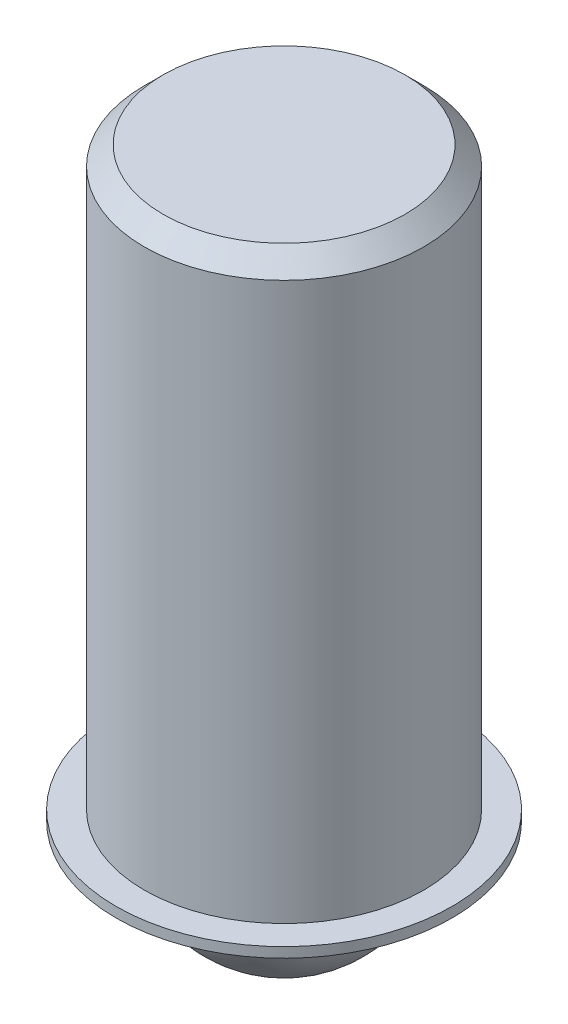
ISO-10303-21;
HEADER;
FILE_DESCRIPTION(('STEP AP214'),'2;1');
FILE_NAME('part.step','',(''),(''),'','','');
FILE_SCHEMA(('AUTOMOTIVE_DESIGN { 1 0 10303 214 1 1 1 1 }'));
ENDSEC;
DATA;
#1=APPLICATION_CONTEXT('core data for automotive mechanical design processes');
#2=APPLICATION_PROTOCOL_DEFINITION('international standard','automotive_design',2000,#1);
#3=PRODUCT_CONTEXT('',#1,'mechanical');
#4=PRODUCT('Part','Part','',(#3));
#5=PRODUCT_RELATED_PRODUCT_CATEGORY('part','',(#4));
#6=PRODUCT_DEFINITION_FORMATION('','',#4);
#7=PRODUCT_DEFINITION_CONTEXT('part definition',#1,'design');
#8=PRODUCT_DEFINITION('design','',#6,#7);
#9=PRODUCT_DEFINITION_SHAPE('','',#8);
#10=(LENGTH_UNIT() NAMED_UNIT(*) SI_UNIT(.MILLI.,.METRE.));
#11=(NAMED_UNIT(*) PLANE_ANGLE_UNIT() SI_UNIT($,.RADIAN.));
#12=(NAMED_UNIT(*) SI_UNIT($,.STERADIAN.) SOLID_ANGLE_UNIT());
#13=UNCERTAINTY_MEASURE_WITH_UNIT(LENGTH_MEASURE(1.E-05),#10,'distance_accuracy_value','');
#14=(GEOMETRIC_REPRESENTATION_CONTEXT(3) GLOBAL_UNCERTAINTY_ASSIGNED_CONTEXT((#13)) GLOBAL_UNIT_ASSIGNED_CONTEXT((#10,
#11,#12)) REPRESENTATION_CONTEXT('',''));
#15=CARTESIAN_POINT('',(0.,0.,0.));
#16=DIRECTION('',(0.,0.,1.));
#17=DIRECTION('',(1.,0.,0.));
#18=AXIS2_PLACEMENT_3D('',#15,#16,#17);
#19=CARTESIAN_POINT('',(0.,-6.7056,0.));
#20=DIRECTION('',(0.,0.,1.));
#21=DIRECTION('',(0.,1.,0.));
#22=AXIS2_PLACEMENT_3D('',#19,#20,#21);
#23=SPHERICAL_SURFACE('',#22,3.175);
#24=CARTESIAN_POINT('',(0.,-6.7056,-3.175));
#25=VERTEX_POINT('',#24);
#26=VERTEX_LOOP('',#25);
#27=FACE_BOUND('',#26,.T.);
#28=CARTESIAN_POINT('',(0.,-6.7056,3.175));
#29=VERTEX_POINT('',#28);
#30=VERTEX_LOOP('',#29);
#31=FACE_BOUND('',#30,.T.);
#32=ADVANCED_FACE('P0_F15',(#27,#31),#23,.T.);
#33=CLOSED_SHELL('',(#32));
#34=MANIFOLD_SOLID_BREP('P0_B1',#33);
#35=CARTESIAN_POINT('',(0.,-6.4516,3.175));
#36=DIRECTION('',(0.,-1.,0.));
#37=DIRECTION('',(0.,0.,-1.));
#38=AXIS2_PLACEMENT_3D('',#35,#36,#37);
#39=PLANE('',#38);
#40=CARTESIAN_POINT('',(0.,-6.4516,0.));
#41=DIRECTION('',(0.,1.,0.));
#42=DIRECTION('',(0.,0.,1.));
#43=AXIS2_PLACEMENT_3D('',#40,#41,#42);
#44=CIRCLE('',#43,3.175);
#45=CARTESIAN_POINT('',(0.,-6.4516,3.175));
#46=VERTEX_POINT('',#45);
#47=EDGE_CURVE('P1_E17',#46,#46,#44,.F.);
#48=ORIENTED_EDGE('',*,*,#47,.T.);
#49=EDGE_LOOP('',(#48));
#50=FACE_BOUND('',#49,.T.);
#51=ADVANCED_FACE('P1_F14',(#50),#39,.T.);
#52=CARTESIAN_POINT('',(0.,9.8806,0.));
#53=DIRECTION('',(0.,1.,0.));
#54=DIRECTION('',(0.,0.,1.));
#55=AXIS2_PLACEMENT_3D('',#52,#53,#54);
#56=CYLINDRICAL_SURFACE('',#55,3.175);
#57=ORIENTED_EDGE('',*,*,#47,.F.);
#58=EDGE_LOOP('',(#57));
#59=FACE_BOUND('',#58,.T.);
#60=CARTESIAN_POINT('',(0.,-7.5946,0.));
#61=DIRECTION('',(0.,1.,0.));
#62=DIRECTION('',(0.,0.,1.));
#63=AXIS2_PLACEMENT_3D('',#60,#61,#62);
#64=CIRCLE('',#63,3.175);
#65=CARTESIAN_POINT('',(0.,-7.5946,3.175));
#66=VERTEX_POINT('',#65);
#67=EDGE_CURVE('P1_E40',#66,#66,#64,.T.);
#68=ORIENTED_EDGE('',*,*,#67,.F.);
#69=EDGE_LOOP('',(#68));
#70=FACE_BOUND('',#69,.T.);
#71=ADVANCED_FACE('P1_F48',(#59,#70),#56,.F.);
#72=CARTESIAN_POINT('',(0.,-7.5946,3.429));
#73=DIRECTION('',(0.,-1.,0.));
#74=DIRECTION('',(0.,0.,-1.));
#75=AXIS2_PLACEMENT_3D('',#72,#73,#74);
#76=PLANE('',#75);
#77=ORIENTED_EDGE('',*,*,#67,.T.);
#78=EDGE_LOOP('',(#77));
#79=FACE_BOUND('',#78,.T.);
#80=CARTESIAN_POINT('',(0.,-7.5945999999476,0.));
#81=DIRECTION('',(0.,1.,0.));
#82=DIRECTION('',(0.,0.,1.));
#83=AXIS2_PLACEMENT_3D('',#80,#81,#82);
#84=CIRCLE('',#83,3.42900000003965);
#85=CARTESIAN_POINT('',(0.,-7.5945999999476,3.42900000003965));
#86=VERTEX_POINT('',#85);
#87=EDGE_CURVE('P1_E38',#86,#86,#84,.T.);
#88=ORIENTED_EDGE('',*,*,#87,.F.);
#89=EDGE_LOOP('',(#88));
#90=FACE_BOUND('',#89,.T.);
#91=ADVANCED_FACE('P1_F51',(#79,#90),#76,.T.);
#92=CARTESIAN_POINT('',(0.,-6.73735000003717,0.));
#93=DIRECTION('',(0.,1.,0.));
#94=DIRECTION('',(0.,0.,1.));
#95=AXIS2_PLACEMENT_3D('',#92,#93,#94);
#96=CONICAL_SURFACE('',#95,4.76249999991296,0.999458846965579);
#97=ORIENTED_EDGE('',*,*,#87,.T.);
#98=EDGE_LOOP('',(#97));
#99=FACE_BOUND('',#98,.T.);
#100=CARTESIAN_POINT('',(0.,-6.73735,0.));
#101=DIRECTION('',(0.,1.,0.));
#102=DIRECTION('',(0.,0.,1.));
#103=AXIS2_PLACEMENT_3D('',#100,#101,#102);
#104=CIRCLE('',#103,4.7625);
#105=CARTESIAN_POINT('',(0.,-6.73735,4.7625));
#106=VERTEX_POINT('',#105);
#107=EDGE_CURVE('P1_E37',#106,#106,#104,.T.);
#108=ORIENTED_EDGE('',*,*,#107,.F.);
#109=EDGE_LOOP('',(#108));
#110=FACE_BOUND('',#109,.T.);
#111=ADVANCED_FACE('P1_F57',(#99,#110),#96,.T.);
#112=CARTESIAN_POINT('',(0.,9.8806,3.429));
#113=DIRECTION('',(0.,1.,0.));
#114=DIRECTION('',(0.,0.,1.));
#115=AXIS2_PLACEMENT_3D('',#112,#113,#114);
#116=PLANE('',#115);
#117=CARTESIAN_POINT('',(0.,9.88060000003088,0.));
#118=DIRECTION('',(0.,-1.,0.));
#119=DIRECTION('',(0.,0.,-1.));
#120=AXIS2_PLACEMENT_3D('',#117,#118,#119);
#121=CIRCLE('',#120,3.42899999998281);
#122=CARTESIAN_POINT('',(0.,9.88060000003088,-3.42899999998281));
#123=VERTEX_POINT('',#122);
#124=EDGE_CURVE('P1_E34',#123,#123,#121,.T.);
#125=ORIENTED_EDGE('',*,*,#124,.F.);
#126=EDGE_LOOP('',(#125));
#127=FACE_BOUND('',#126,.T.);
#128=ADVANCED_FACE('P1_F77',(#127),#116,.T.);
#129=CARTESIAN_POINT('',(0.,9.8806,0.));
#130=DIRECTION('',(0.,1.,0.));
#131=DIRECTION('',(0.,0.,1.));
#132=AXIS2_PLACEMENT_3D('',#129,#130,#131);
#133=CYLINDRICAL_SURFACE('',#132,4.7625);
#134=ORIENTED_EDGE('',*,*,#107,.T.);
#135=EDGE_LOOP('',(#134));
#136=FACE_BOUND('',#135,.T.);
#137=CARTESIAN_POINT('',(0.,-6.4516,0.));
#138=DIRECTION('',(0.,1.,0.));
#139=DIRECTION('',(0.,0.,1.));
#140=AXIS2_PLACEMENT_3D('',#137,#138,#139);
#141=CIRCLE('',#140,4.7625);
#142=CARTESIAN_POINT('',(0.,-6.4516,4.7625));
#143=VERTEX_POINT('',#142);
#144=EDGE_CURVE('P1_E26',#143,#143,#141,.T.);
#145=ORIENTED_EDGE('',*,*,#144,.F.);
#146=EDGE_LOOP('',(#145));
#147=FACE_BOUND('',#146,.T.);
#148=ADVANCED_FACE('P1_F73',(#136,#147),#133,.T.);
#149=CARTESIAN_POINT('',(0.,9.34719999986555,0.));
#150=DIRECTION('',(0.,-1.,0.));
#151=DIRECTION('',(0.,0.,-1.));
#152=AXIS2_PLACEMENT_3D('',#149,#150,#151);
#153=CONICAL_SURFACE('',#152,3.96240000009129,0.785398163344164);
#154=ORIENTED_EDGE('',*,*,#124,.T.);
#155=EDGE_LOOP('',(#154));
#156=FACE_BOUND('',#155,.T.);
#157=CARTESIAN_POINT('',(0.,9.3472,0.));
#158=DIRECTION('',(0.,1.,0.));
#159=DIRECTION('',(0.,0.,1.));
#160=AXIS2_PLACEMENT_3D('',#157,#158,#159);
#161=CIRCLE('',#160,3.9624);
#162=CARTESIAN_POINT('',(0.,9.3472,3.9624));
#163=VERTEX_POINT('',#162);
#164=EDGE_CURVE('P1_E21',#163,#163,#161,.F.);
#165=ORIENTED_EDGE('',*,*,#164,.F.);
#166=EDGE_LOOP('',(#165));
#167=FACE_BOUND('',#166,.T.);
#168=ADVANCED_FACE('P1_F66',(#156,#167),#153,.T.);
#169=CARTESIAN_POINT('',(0.,-6.4516,4.7625));
#170=DIRECTION('',(0.,1.,0.));
#171=DIRECTION('',(0.,0.,1.));
#172=AXIS2_PLACEMENT_3D('',#169,#170,#171);
#173=PLANE('',#172);
#174=CARTESIAN_POINT('',(0.,-6.4516,0.));
#175=DIRECTION('',(0.,1.,0.));
#176=DIRECTION('',(0.,0.,1.));
#177=AXIS2_PLACEMENT_3D('',#174,#175,#176);
#178=CIRCLE('',#177,3.9624);
#179=CARTESIAN_POINT('',(0.,-6.4516,3.9624));
#180=VERTEX_POINT('',#179);
#181=EDGE_CURVE('P1_E10',#180,#180,#178,.T.);
#182=ORIENTED_EDGE('',*,*,#181,.F.);
#183=EDGE_LOOP('',(#182));
#184=FACE_BOUND('',#183,.T.);
#185=ORIENTED_EDGE('',*,*,#144,.T.);
#186=EDGE_LOOP('',(#185));
#187=FACE_BOUND('',#186,.T.);
#188=ADVANCED_FACE('P1_F61',(#184,#187),#173,.T.);
#189=CARTESIAN_POINT('',(0.,9.8806,0.));
#190=DIRECTION('',(0.,1.,0.));
#191=DIRECTION('',(0.,0.,1.));
#192=AXIS2_PLACEMENT_3D('',#189,#190,#191);
#193=CYLINDRICAL_SURFACE('',#192,3.9624);
#194=ORIENTED_EDGE('',*,*,#181,.T.);
#195=EDGE_LOOP('',(#194));
#196=FACE_BOUND('',#195,.T.);
#197=ORIENTED_EDGE('',*,*,#164,.T.);
#198=EDGE_LOOP('',(#197));
#199=FACE_BOUND('',#198,.T.);
#200=ADVANCED_FACE('P1_F59',(#196,#199),#193,.T.);
#201=CLOSED_SHELL('',(#51,#71,#91,#111,#128,#148,#168,#188,#200));
#202=MANIFOLD_SOLID_BREP('P1_B1',#201);
#203=ADVANCED_BREP_SHAPE_REPRESENTATION('',(#18,#34,#202),#14);
#204=SHAPE_DEFINITION_REPRESENTATION(#9,#203);
ENDSEC;
END-ISO-10303-21;
